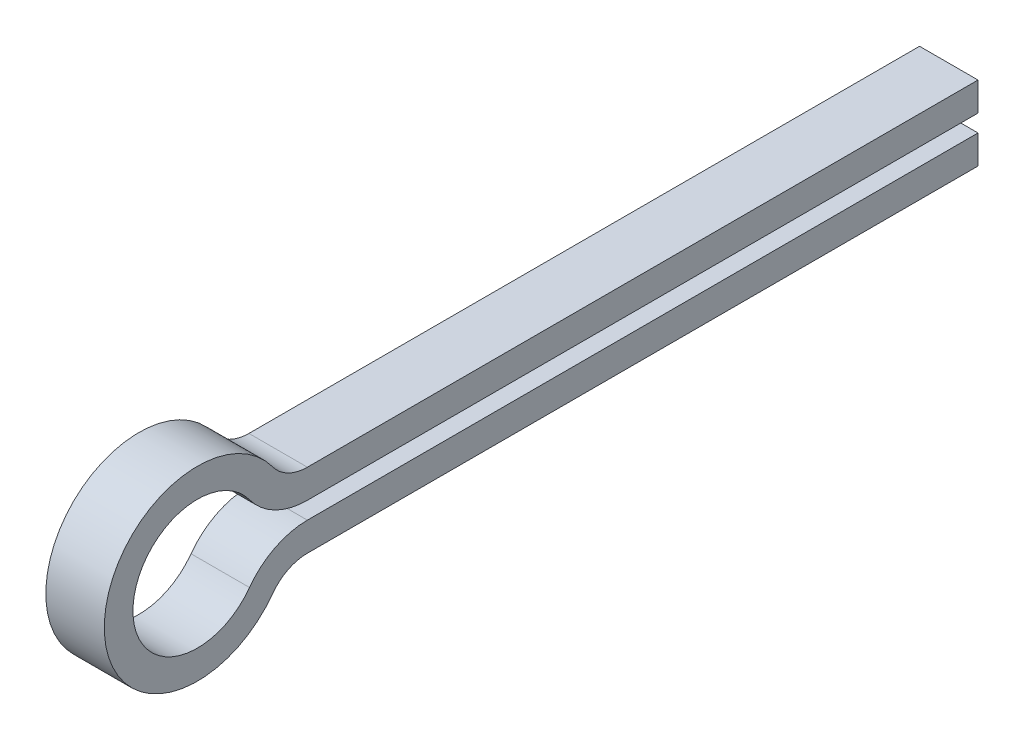
ISO-10303-21;
HEADER;
FILE_DESCRIPTION(('STEP AP214'),'2;1');
FILE_NAME('part.step','',(''),(''),'','','');
FILE_SCHEMA(('AUTOMOTIVE_DESIGN { 1 0 10303 214 1 1 1 1 }'));
ENDSEC;
DATA;
#1=APPLICATION_CONTEXT('core data for automotive mechanical design processes');
#2=APPLICATION_PROTOCOL_DEFINITION('international standard','automotive_design',2000,#1);
#3=PRODUCT_CONTEXT('',#1,'mechanical');
#4=PRODUCT('Part','Part','',(#3));
#5=PRODUCT_RELATED_PRODUCT_CATEGORY('part','',(#4));
#6=PRODUCT_DEFINITION_FORMATION('','',#4);
#7=PRODUCT_DEFINITION_CONTEXT('part definition',#1,'design');
#8=PRODUCT_DEFINITION('design','',#6,#7);
#9=PRODUCT_DEFINITION_SHAPE('','',#8);
#10=(LENGTH_UNIT() NAMED_UNIT(*) SI_UNIT(.MILLI.,.METRE.));
#11=(NAMED_UNIT(*) PLANE_ANGLE_UNIT() SI_UNIT($,.RADIAN.));
#12=(NAMED_UNIT(*) SI_UNIT($,.STERADIAN.) SOLID_ANGLE_UNIT());
#13=UNCERTAINTY_MEASURE_WITH_UNIT(LENGTH_MEASURE(1.E-05),#10,'distance_accuracy_value','');
#14=(GEOMETRIC_REPRESENTATION_CONTEXT(3) GLOBAL_UNCERTAINTY_ASSIGNED_CONTEXT((#13)) GLOBAL_UNIT_ASSIGNED_CONTEXT((#10,
#11,#12)) REPRESENTATION_CONTEXT('',''));
#15=CARTESIAN_POINT('',(0.,0.,0.));
#16=DIRECTION('',(0.,0.,1.));
#17=DIRECTION('',(1.,0.,0.));
#18=AXIS2_PLACEMENT_3D('',#15,#16,#17);
#19=CARTESIAN_POINT('',(0.255,0.,0.902918837048));
#20=DIRECTION('',(1.,0.,0.));
#21=DIRECTION('',(0.,1.,0.));
#22=AXIS2_PLACEMENT_3D('',#19,#20,#21);
#23=PLANE('',#22);
#24=CARTESIAN_POINT('',(0.255,-0.7,2.850302478383));
#25=DIRECTION('',(1.,0.,0.));
#26=DIRECTION('',(0.,0.,-1.));
#27=AXIS2_PLACEMENT_3D('',#24,#25,#26);
#28=CIRCLE('',#27,0.625);
#29=CARTESIAN_POINT('',(0.255,-0.331578947368313,3.35516971635491));
#30=VERTEX_POINT('',#29);
#31=CARTESIAN_POINT('',(0.255,-0.075,2.850302478383));
#32=VERTEX_POINT('',#31);
#33=EDGE_CURVE('E173',#30,#32,#28,.F.);
#34=ORIENTED_EDGE('',*,*,#33,.F.);
#35=CARTESIAN_POINT('',(0.255,0.,3.80955023053));
#36=DIRECTION('',(1.,0.,0.));
#37=DIRECTION('',(0.,0.,-1.));
#38=AXIS2_PLACEMENT_3D('',#35,#36,#37);
#39=CIRCLE('',#38,0.5625);
#40=CARTESIAN_POINT('',(0.255,0.331578947368198,3.35516971635507));
#41=VERTEX_POINT('',#40);
#42=EDGE_CURVE('E169',#30,#41,#39,.F.);
#43=ORIENTED_EDGE('',*,*,#42,.T.);
#44=CARTESIAN_POINT('',(0.255,0.7,2.850302478383));
#45=DIRECTION('',(1.,0.,0.));
#46=DIRECTION('',(0.,0.,-1.));
#47=AXIS2_PLACEMENT_3D('',#44,#45,#46);
#48=CIRCLE('',#47,0.625);
#49=CARTESIAN_POINT('',(0.255,0.075,2.850302478383));
#50=VERTEX_POINT('',#49);
#51=EDGE_CURVE('E167',#50,#41,#48,.F.);
#52=ORIENTED_EDGE('',*,*,#51,.F.);
#53=DIRECTION('',(0.,0.,-1.));
#54=VECTOR('',#53,1.);
#55=CARTESIAN_POINT('',(0.255,0.075,-0.07484876080865));
#56=LINE('',#55,#54);
#57=CARTESIAN_POINT('',(0.255,0.075,-3.));
#58=VERTEX_POINT('',#57);
#59=EDGE_CURVE('E106',#58,#50,#56,.F.);
#60=ORIENTED_EDGE('',*,*,#59,.F.);
#61=DIRECTION('',(0.,1.,0.));
#62=VECTOR('',#61,1.);
#63=CARTESIAN_POINT('',(0.255,0.2,-3.));
#64=LINE('',#63,#62);
#65=CARTESIAN_POINT('',(0.255,0.325,-3.));
#66=VERTEX_POINT('',#65);
#67=EDGE_CURVE('E101',#66,#58,#64,.F.);
#68=ORIENTED_EDGE('',*,*,#67,.F.);
#69=DIRECTION('',(0.,0.,1.));
#70=VECTOR('',#69,1.);
#71=CARTESIAN_POINT('',(0.255,0.325,-0.07484876080865));
#72=LINE('',#71,#70);
#73=CARTESIAN_POINT('',(0.255,0.325,2.850302478383));
#74=VERTEX_POINT('',#73);
#75=EDGE_CURVE('E89',#74,#66,#72,.F.);
#76=ORIENTED_EDGE('',*,*,#75,.F.);
#77=CARTESIAN_POINT('',(0.255,0.7,2.850302478383));
#78=DIRECTION('',(1.,0.,0.));
#79=DIRECTION('',(0.,0.,-1.));
#80=AXIS2_PLACEMENT_3D('',#77,#78,#79);
#81=CIRCLE('',#80,0.375);
#82=CARTESIAN_POINT('',(0.255,0.478947368421052,3.1532228211661));
#83=VERTEX_POINT('',#82);
#84=EDGE_CURVE('E20',#74,#83,#81,.F.);
#85=ORIENTED_EDGE('',*,*,#84,.T.);
#86=CARTESIAN_POINT('',(0.255,0.,3.80955023053));
#87=DIRECTION('',(1.,0.,0.));
#88=DIRECTION('',(0.,0.,-1.));
#89=AXIS2_PLACEMENT_3D('',#86,#87,#88);
#90=CIRCLE('',#89,0.8125);
#91=CARTESIAN_POINT('',(0.255,-0.478947368420936,3.15322282116625));
#92=VERTEX_POINT('',#91);
#93=EDGE_CURVE('E178',#92,#83,#90,.F.);
#94=ORIENTED_EDGE('',*,*,#93,.F.);
#95=CARTESIAN_POINT('',(0.255,-0.7,2.850302478383));
#96=DIRECTION('',(1.,0.,0.));
#97=DIRECTION('',(0.,0.,-1.));
#98=AXIS2_PLACEMENT_3D('',#95,#96,#97);
#99=CIRCLE('',#98,0.375);
#100=CARTESIAN_POINT('',(0.255,-0.325,2.850302478383));
#101=VERTEX_POINT('',#100);
#102=EDGE_CURVE('E142',#92,#101,#99,.F.);
#103=ORIENTED_EDGE('',*,*,#102,.T.);
#104=DIRECTION('',(0.,0.,-1.));
#105=VECTOR('',#104,1.);
#106=CARTESIAN_POINT('',(0.255,-0.325,-0.07484876080865));
#107=LINE('',#106,#105);
#108=CARTESIAN_POINT('',(0.255,-0.325,-3.));
#109=VERTEX_POINT('',#108);
#110=EDGE_CURVE('E140',#109,#101,#107,.F.);
#111=ORIENTED_EDGE('',*,*,#110,.F.);
#112=DIRECTION('',(0.,1.,0.));
#113=VECTOR('',#112,1.);
#114=CARTESIAN_POINT('',(0.255,-0.2,-3.));
#115=LINE('',#114,#113);
#116=CARTESIAN_POINT('',(0.255,-0.0749999999999999,-3.));
#117=VERTEX_POINT('',#116);
#118=EDGE_CURVE('E134',#117,#109,#115,.F.);
#119=ORIENTED_EDGE('',*,*,#118,.F.);
#120=DIRECTION('',(0.,0.,1.));
#121=VECTOR('',#120,1.);
#122=CARTESIAN_POINT('',(0.255,-0.075,-0.07484876080865));
#123=LINE('',#122,#121);
#124=EDGE_CURVE('E127',#32,#117,#123,.F.);
#125=ORIENTED_EDGE('',*,*,#124,.F.);
#126=EDGE_LOOP('',(#34,#43,#52,#60,#68,#76,#85,#94,#103,#111,#119,#125));
#127=FACE_BOUND('',#126,.T.);
#128=ADVANCED_FACE('F17',(#127),#23,.T.);
#129=CARTESIAN_POINT('',(-0.255,0.2,-3.));
#130=DIRECTION('',(0.,0.,-1.));
#131=DIRECTION('',(-1.,0.,0.));
#132=AXIS2_PLACEMENT_3D('',#129,#130,#131);
#133=PLANE('',#132);
#134=DIRECTION('',(0.,1.,0.));
#135=VECTOR('',#134,1.);
#136=CARTESIAN_POINT('',(-0.255,0.,-3.));
#137=LINE('',#136,#135);
#138=CARTESIAN_POINT('',(-0.255,0.075,-3.));
#139=VERTEX_POINT('',#138);
#140=CARTESIAN_POINT('',(-0.255,0.325,-3.));
#141=VERTEX_POINT('',#140);
#142=EDGE_CURVE('E114',#139,#141,#137,.T.);
#143=ORIENTED_EDGE('',*,*,#142,.T.);
#144=DIRECTION('',(1.,0.,0.));
#145=VECTOR('',#144,1.);
#146=CARTESIAN_POINT('',(-0.255,0.325,-3.));
#147=LINE('',#146,#145);
#148=EDGE_CURVE('E98',#66,#141,#147,.F.);
#149=ORIENTED_EDGE('',*,*,#148,.F.);
#150=ORIENTED_EDGE('',*,*,#67,.T.);
#151=DIRECTION('',(1.,0.,0.));
#152=VECTOR('',#151,1.);
#153=CARTESIAN_POINT('',(-0.255,0.075,-3.));
#154=LINE('',#153,#152);
#155=EDGE_CURVE('E222',#139,#58,#154,.T.);
#156=ORIENTED_EDGE('',*,*,#155,.F.);
#157=EDGE_LOOP('',(#143,#149,#150,#156));
#158=FACE_BOUND('',#157,.T.);
#159=ADVANCED_FACE('F112',(#158),#133,.T.);
#160=CARTESIAN_POINT('',(-0.255,0.325,-0.07484876080865));
#161=DIRECTION('',(0.,1.,0.));
#162=DIRECTION('',(0.,0.,1.));
#163=AXIS2_PLACEMENT_3D('',#160,#161,#162);
#164=PLANE('',#163);
#165=DIRECTION('',(0.,0.,1.));
#166=VECTOR('',#165,1.);
#167=CARTESIAN_POINT('',(-0.255,0.325,0.902918837048));
#168=LINE('',#167,#166);
#169=CARTESIAN_POINT('',(-0.255,0.325,2.850302478383));
#170=VERTEX_POINT('',#169);
#171=EDGE_CURVE('E166',#141,#170,#168,.T.);
#172=ORIENTED_EDGE('',*,*,#171,.T.);
#173=DIRECTION('',(1.,0.,0.));
#174=VECTOR('',#173,1.);
#175=CARTESIAN_POINT('',(-0.255,0.325,2.850302478383));
#176=LINE('',#175,#174);
#177=EDGE_CURVE('E100',#170,#74,#176,.T.);
#178=ORIENTED_EDGE('',*,*,#177,.T.);
#179=ORIENTED_EDGE('',*,*,#75,.T.);
#180=ORIENTED_EDGE('',*,*,#148,.T.);
#181=EDGE_LOOP('',(#172,#178,#179,#180));
#182=FACE_BOUND('',#181,.T.);
#183=ADVANCED_FACE('F96',(#182),#164,.T.);
#184=CARTESIAN_POINT('',(-0.255,0.7,2.850302478383));
#185=DIRECTION('',(1.,0.,0.));
#186=DIRECTION('',(0.,0.,-1.));
#187=AXIS2_PLACEMENT_3D('',#184,#185,#186);
#188=CYLINDRICAL_SURFACE('',#187,0.375);
#189=ORIENTED_EDGE('',*,*,#177,.F.);
#190=CARTESIAN_POINT('',(-0.255,0.7,2.850302478383));
#191=DIRECTION('',(1.,0.,0.));
#192=DIRECTION('',(0.,0.,-1.));
#193=AXIS2_PLACEMENT_3D('',#190,#191,#192);
#194=CIRCLE('',#193,0.375);
#195=CARTESIAN_POINT('',(-0.255,0.478947368421052,3.1532228211661));
#196=VERTEX_POINT('',#195);
#197=EDGE_CURVE('E163',#170,#196,#194,.F.);
#198=ORIENTED_EDGE('',*,*,#197,.T.);
#199=DIRECTION('',(1.,0.,0.));
#200=VECTOR('',#199,1.);
#201=CARTESIAN_POINT('',(-0.255,0.47894736842105,3.15322282116593));
#202=LINE('',#201,#200);
#203=EDGE_CURVE('E179',#83,#196,#202,.F.);
#204=ORIENTED_EDGE('',*,*,#203,.F.);
#205=ORIENTED_EDGE('',*,*,#84,.F.);
#206=EDGE_LOOP('',(#189,#198,#204,#205));
#207=FACE_BOUND('',#206,.T.);
#208=ADVANCED_FACE('F185',(#207),#188,.F.);
#209=CARTESIAN_POINT('',(-0.255,0.,3.80955023053));
#210=DIRECTION('',(1.,0.,0.));
#211=DIRECTION('',(0.,0.,-1.));
#212=AXIS2_PLACEMENT_3D('',#209,#210,#211);
#213=CYLINDRICAL_SURFACE('',#212,0.8125);
#214=CARTESIAN_POINT('',(-0.255,0.,3.80955023053));
#215=DIRECTION('',(1.,0.,0.));
#216=DIRECTION('',(0.,0.,-1.));
#217=AXIS2_PLACEMENT_3D('',#214,#215,#216);
#218=CIRCLE('',#217,0.8125);
#219=CARTESIAN_POINT('',(-0.255,-0.478947368420936,3.15322282116625));
#220=VERTEX_POINT('',#219);
#221=EDGE_CURVE('E160',#196,#220,#218,.T.);
#222=ORIENTED_EDGE('',*,*,#221,.T.);
#223=DIRECTION('',(1.,0.,0.));
#224=VECTOR('',#223,1.);
#225=CARTESIAN_POINT('',(-0.255,-0.47894736842082,3.15322282116625));
#226=LINE('',#225,#224);
#227=EDGE_CURVE('E177',#220,#92,#226,.T.);
#228=ORIENTED_EDGE('',*,*,#227,.T.);
#229=ORIENTED_EDGE('',*,*,#93,.T.);
#230=ORIENTED_EDGE('',*,*,#203,.T.);
#231=EDGE_LOOP('',(#222,#228,#229,#230));
#232=FACE_BOUND('',#231,.T.);
#233=ADVANCED_FACE('F188',(#232),#213,.T.);
#234=CARTESIAN_POINT('',(-0.255,-0.7,2.850302478383));
#235=DIRECTION('',(1.,0.,0.));
#236=DIRECTION('',(0.,0.,-1.));
#237=AXIS2_PLACEMENT_3D('',#234,#235,#236);
#238=CYLINDRICAL_SURFACE('',#237,0.375);
#239=ORIENTED_EDGE('',*,*,#227,.F.);
#240=CARTESIAN_POINT('',(-0.255,-0.7,2.850302478383));
#241=DIRECTION('',(1.,0.,0.));
#242=DIRECTION('',(0.,0.,-1.));
#243=AXIS2_PLACEMENT_3D('',#240,#241,#242);
#244=CIRCLE('',#243,0.375);
#245=CARTESIAN_POINT('',(-0.255,-0.325,2.850302478383));
#246=VERTEX_POINT('',#245);
#247=EDGE_CURVE('E156',#220,#246,#244,.F.);
#248=ORIENTED_EDGE('',*,*,#247,.T.);
#249=DIRECTION('',(1.,0.,0.));
#250=VECTOR('',#249,1.);
#251=CARTESIAN_POINT('',(-0.255,-0.325,2.850302478383));
#252=LINE('',#251,#250);
#253=EDGE_CURVE('E137',#101,#246,#252,.F.);
#254=ORIENTED_EDGE('',*,*,#253,.F.);
#255=ORIENTED_EDGE('',*,*,#102,.F.);
#256=EDGE_LOOP('',(#239,#248,#254,#255));
#257=FACE_BOUND('',#256,.T.);
#258=ADVANCED_FACE('F198',(#257),#238,.F.);
#259=CARTESIAN_POINT('',(-0.255,-0.325,-0.07484876080865));
#260=DIRECTION('',(0.,-1.,0.));
#261=DIRECTION('',(0.,0.,-1.));
#262=AXIS2_PLACEMENT_3D('',#259,#260,#261);
#263=PLANE('',#262);
#264=DIRECTION('',(0.,0.,1.));
#265=VECTOR('',#264,1.);
#266=CARTESIAN_POINT('',(-0.255,-0.325,0.902918837048));
#267=LINE('',#266,#265);
#268=CARTESIAN_POINT('',(-0.255,-0.325,-3.));
#269=VERTEX_POINT('',#268);
#270=EDGE_CURVE('E159',#246,#269,#267,.F.);
#271=ORIENTED_EDGE('',*,*,#270,.T.);
#272=DIRECTION('',(-1.,0.,0.));
#273=VECTOR('',#272,1.);
#274=CARTESIAN_POINT('',(-0.255,-0.325,-3.));
#275=LINE('',#274,#273);
#276=EDGE_CURVE('E131',#109,#269,#275,.T.);
#277=ORIENTED_EDGE('',*,*,#276,.F.);
#278=ORIENTED_EDGE('',*,*,#110,.T.);
#279=ORIENTED_EDGE('',*,*,#253,.T.);
#280=EDGE_LOOP('',(#271,#277,#278,#279));
#281=FACE_BOUND('',#280,.T.);
#282=ADVANCED_FACE('F253',(#281),#263,.T.);
#283=CARTESIAN_POINT('',(-0.255,-0.2,-3.));
#284=DIRECTION('',(0.,0.,-1.));
#285=DIRECTION('',(-1.,0.,0.));
#286=AXIS2_PLACEMENT_3D('',#283,#284,#285);
#287=PLANE('',#286);
#288=DIRECTION('',(0.,1.,0.));
#289=VECTOR('',#288,1.);
#290=CARTESIAN_POINT('',(-0.255,0.,-3.));
#291=LINE('',#290,#289);
#292=CARTESIAN_POINT('',(-0.255,-0.0749999999999999,-3.));
#293=VERTEX_POINT('',#292);
#294=EDGE_CURVE('E208',#269,#293,#291,.T.);
#295=ORIENTED_EDGE('',*,*,#294,.T.);
#296=DIRECTION('',(1.,0.,0.));
#297=VECTOR('',#296,1.);
#298=CARTESIAN_POINT('',(-0.255,-0.0749999999999999,-3.));
#299=LINE('',#298,#297);
#300=EDGE_CURVE('E130',#117,#293,#299,.F.);
#301=ORIENTED_EDGE('',*,*,#300,.F.);
#302=ORIENTED_EDGE('',*,*,#118,.T.);
#303=ORIENTED_EDGE('',*,*,#276,.T.);
#304=EDGE_LOOP('',(#295,#301,#302,#303));
#305=FACE_BOUND('',#304,.T.);
#306=ADVANCED_FACE('F247',(#305),#287,.T.);
#307=CARTESIAN_POINT('',(-0.255,-0.075,-0.07484876080865));
#308=DIRECTION('',(0.,1.,0.));
#309=DIRECTION('',(0.,0.,1.));
#310=AXIS2_PLACEMENT_3D('',#307,#308,#309);
#311=PLANE('',#310);
#312=DIRECTION('',(0.,0.,1.));
#313=VECTOR('',#312,1.);
#314=CARTESIAN_POINT('',(-0.255,-0.075,0.902918837048));
#315=LINE('',#314,#313);
#316=CARTESIAN_POINT('',(-0.255,-0.075,2.850302478383));
#317=VERTEX_POINT('',#316);
#318=EDGE_CURVE('E155',#293,#317,#315,.T.);
#319=ORIENTED_EDGE('',*,*,#318,.T.);
#320=DIRECTION('',(1.,0.,0.));
#321=VECTOR('',#320,1.);
#322=CARTESIAN_POINT('',(-0.255,-0.075,2.850302478383));
#323=LINE('',#322,#321);
#324=EDGE_CURVE('E175',#32,#317,#323,.F.);
#325=ORIENTED_EDGE('',*,*,#324,.F.);
#326=ORIENTED_EDGE('',*,*,#124,.T.);
#327=ORIENTED_EDGE('',*,*,#300,.T.);
#328=EDGE_LOOP('',(#319,#325,#326,#327));
#329=FACE_BOUND('',#328,.T.);
#330=ADVANCED_FACE('F241',(#329),#311,.T.);
#331=CARTESIAN_POINT('',(-0.255,-0.7,2.850302478383));
#332=DIRECTION('',(1.,0.,0.));
#333=DIRECTION('',(0.,0.,-1.));
#334=AXIS2_PLACEMENT_3D('',#331,#332,#333);
#335=CYLINDRICAL_SURFACE('',#334,0.625);
#336=CARTESIAN_POINT('',(-0.255,-0.7,2.850302478383));
#337=DIRECTION('',(1.,0.,0.));
#338=DIRECTION('',(0.,0.,-1.));
#339=AXIS2_PLACEMENT_3D('',#336,#337,#338);
#340=CIRCLE('',#339,0.625);
#341=CARTESIAN_POINT('',(-0.255,-0.331578947368313,3.35516971635491));
#342=VERTEX_POINT('',#341);
#343=EDGE_CURVE('E152',#317,#342,#340,.T.);
#344=ORIENTED_EDGE('',*,*,#343,.T.);
#345=DIRECTION('',(1.,0.,0.));
#346=VECTOR('',#345,1.);
#347=CARTESIAN_POINT('',(-0.255,-0.331578947368205,3.35516971635472));
#348=LINE('',#347,#346);
#349=EDGE_CURVE('E172',#342,#30,#348,.T.);
#350=ORIENTED_EDGE('',*,*,#349,.T.);
#351=ORIENTED_EDGE('',*,*,#33,.T.);
#352=ORIENTED_EDGE('',*,*,#324,.T.);
#353=EDGE_LOOP('',(#344,#350,#351,#352));
#354=FACE_BOUND('',#353,.T.);
#355=ADVANCED_FACE('F274',(#354),#335,.T.);
#356=CARTESIAN_POINT('',(-0.255,0.,3.80955023053));
#357=DIRECTION('',(1.,0.,0.));
#358=DIRECTION('',(0.,0.,-1.));
#359=AXIS2_PLACEMENT_3D('',#356,#357,#358);
#360=CYLINDRICAL_SURFACE('',#359,0.5625);
#361=ORIENTED_EDGE('',*,*,#349,.F.);
#362=CARTESIAN_POINT('',(-0.255,0.,3.80955023053));
#363=DIRECTION('',(1.,0.,0.));
#364=DIRECTION('',(0.,0.,-1.));
#365=AXIS2_PLACEMENT_3D('',#362,#363,#364);
#366=CIRCLE('',#365,0.5625);
#367=CARTESIAN_POINT('',(-0.255,0.331578947368198,3.35516971635507));
#368=VERTEX_POINT('',#367);
#369=EDGE_CURVE('E149',#342,#368,#366,.F.);
#370=ORIENTED_EDGE('',*,*,#369,.T.);
#371=DIRECTION('',(1.,0.,0.));
#372=VECTOR('',#371,1.);
#373=CARTESIAN_POINT('',(-0.255,0.331578947367975,3.35516971635503));
#374=LINE('',#373,#372);
#375=EDGE_CURVE('E124',#41,#368,#374,.F.);
#376=ORIENTED_EDGE('',*,*,#375,.F.);
#377=ORIENTED_EDGE('',*,*,#42,.F.);
#378=EDGE_LOOP('',(#361,#370,#376,#377));
#379=FACE_BOUND('',#378,.T.);
#380=ADVANCED_FACE('F268',(#379),#360,.F.);
#381=CARTESIAN_POINT('',(-0.255,0.7,2.850302478383));
#382=DIRECTION('',(1.,0.,0.));
#383=DIRECTION('',(0.,0.,-1.));
#384=AXIS2_PLACEMENT_3D('',#381,#382,#383);
#385=CYLINDRICAL_SURFACE('',#384,0.625);
#386=CARTESIAN_POINT('',(-0.255,0.7,2.850302478383));
#387=DIRECTION('',(1.,0.,0.));
#388=DIRECTION('',(0.,0.,-1.));
#389=AXIS2_PLACEMENT_3D('',#386,#387,#388);
#390=CIRCLE('',#389,0.625);
#391=CARTESIAN_POINT('',(-0.255,0.075,2.850302478383));
#392=VERTEX_POINT('',#391);
#393=EDGE_CURVE('E26',#368,#392,#390,.T.);
#394=ORIENTED_EDGE('',*,*,#393,.T.);
#395=DIRECTION('',(1.,0.,0.));
#396=VECTOR('',#395,1.);
#397=CARTESIAN_POINT('',(-0.255,0.075,2.850302478383));
#398=LINE('',#397,#396);
#399=EDGE_CURVE('E34',#50,#392,#398,.F.);
#400=ORIENTED_EDGE('',*,*,#399,.F.);
#401=ORIENTED_EDGE('',*,*,#51,.T.);
#402=ORIENTED_EDGE('',*,*,#375,.T.);
#403=EDGE_LOOP('',(#394,#400,#401,#402));
#404=FACE_BOUND('',#403,.T.);
#405=ADVANCED_FACE('F260',(#404),#385,.T.);
#406=CARTESIAN_POINT('',(-0.255,0.075,-0.07484876080865));
#407=DIRECTION('',(0.,-1.,0.));
#408=DIRECTION('',(0.,0.,-1.));
#409=AXIS2_PLACEMENT_3D('',#406,#407,#408);
#410=PLANE('',#409);
#411=DIRECTION('',(0.,0.,1.));
#412=VECTOR('',#411,1.);
#413=CARTESIAN_POINT('',(-0.255,0.075,0.902918837048));
#414=LINE('',#413,#412);
#415=EDGE_CURVE('E11',#392,#139,#414,.F.);
#416=ORIENTED_EDGE('',*,*,#415,.T.);
#417=ORIENTED_EDGE('',*,*,#155,.T.);
#418=ORIENTED_EDGE('',*,*,#59,.T.);
#419=ORIENTED_EDGE('',*,*,#399,.T.);
#420=EDGE_LOOP('',(#416,#417,#418,#419));
#421=FACE_BOUND('',#420,.T.);
#422=ADVANCED_FACE('F258',(#421),#410,.T.);
#423=CARTESIAN_POINT('',(-0.255,0.,0.902918837048));
#424=DIRECTION('',(1.,0.,0.));
#425=DIRECTION('',(0.,1.,0.));
#426=AXIS2_PLACEMENT_3D('',#423,#424,#425);
#427=PLANE('',#426);
#428=ORIENTED_EDGE('',*,*,#393,.F.);
#429=ORIENTED_EDGE('',*,*,#369,.F.);
#430=ORIENTED_EDGE('',*,*,#343,.F.);
#431=ORIENTED_EDGE('',*,*,#318,.F.);
#432=ORIENTED_EDGE('',*,*,#294,.F.);
#433=ORIENTED_EDGE('',*,*,#270,.F.);
#434=ORIENTED_EDGE('',*,*,#247,.F.);
#435=ORIENTED_EDGE('',*,*,#221,.F.);
#436=ORIENTED_EDGE('',*,*,#197,.F.);
#437=ORIENTED_EDGE('',*,*,#171,.F.);
#438=ORIENTED_EDGE('',*,*,#142,.F.);
#439=ORIENTED_EDGE('',*,*,#415,.F.);
#440=EDGE_LOOP('',(#428,#429,#430,#431,#432,#433,#434,#435,#436,#437,#438,#439));
#441=FACE_BOUND('',#440,.T.);
#442=ADVANCED_FACE('F192',(#441),#427,.F.);
#443=CLOSED_SHELL('',(#128,#159,#183,#208,#233,#258,#282,#306,#330,#355,#380,#405,#422,#442));
#444=MANIFOLD_SOLID_BREP('B1',#443);
#445=ADVANCED_BREP_SHAPE_REPRESENTATION('',(#18,#444),#14);
#446=SHAPE_DEFINITION_REPRESENTATION(#9,#445);
ENDSEC;
END-ISO-10303-21;
